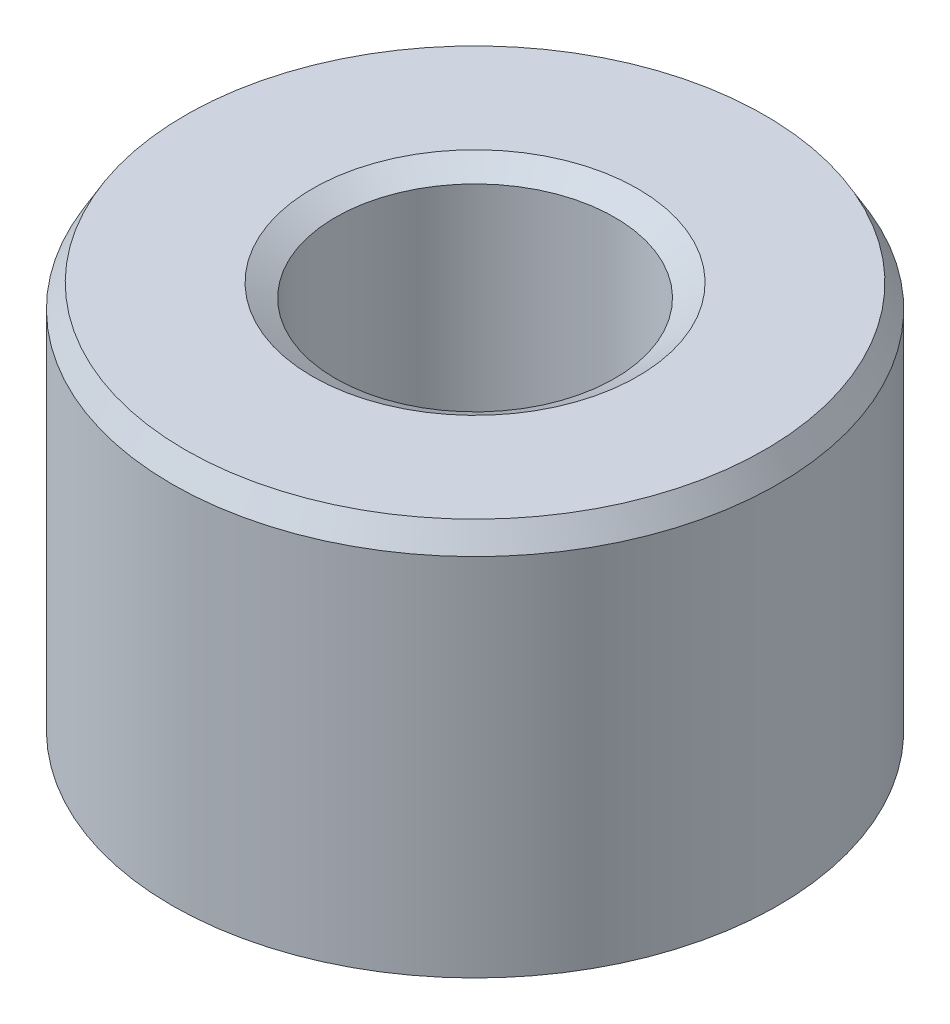
ISO-10303-21;
HEADER;
FILE_DESCRIPTION(('STEP AP214'),'2;1');
FILE_NAME('part.step','',(''),(''),'','','');
FILE_SCHEMA(('AUTOMOTIVE_DESIGN { 1 0 10303 214 1 1 1 1 }'));
ENDSEC;
DATA;
#1=APPLICATION_CONTEXT('core data for automotive mechanical design processes');
#2=APPLICATION_PROTOCOL_DEFINITION('international standard','automotive_design',2000,#1);
#3=PRODUCT_CONTEXT('',#1,'mechanical');
#4=PRODUCT('Part','Part','',(#3));
#5=PRODUCT_RELATED_PRODUCT_CATEGORY('part','',(#4));
#6=PRODUCT_DEFINITION_FORMATION('','',#4);
#7=PRODUCT_DEFINITION_CONTEXT('part definition',#1,'design');
#8=PRODUCT_DEFINITION('design','',#6,#7);
#9=PRODUCT_DEFINITION_SHAPE('','',#8);
#10=(LENGTH_UNIT() NAMED_UNIT(*) SI_UNIT(.MILLI.,.METRE.));
#11=(NAMED_UNIT(*) PLANE_ANGLE_UNIT() SI_UNIT($,.RADIAN.));
#12=(NAMED_UNIT(*) SI_UNIT($,.STERADIAN.) SOLID_ANGLE_UNIT());
#13=UNCERTAINTY_MEASURE_WITH_UNIT(LENGTH_MEASURE(1.E-05),#10,'distance_accuracy_value','');
#14=(GEOMETRIC_REPRESENTATION_CONTEXT(3) GLOBAL_UNCERTAINTY_ASSIGNED_CONTEXT((#13)) GLOBAL_UNIT_ASSIGNED_CONTEXT((#10,
#11,#12)) REPRESENTATION_CONTEXT('',''));
#15=CARTESIAN_POINT('',(0.,0.,0.));
#16=DIRECTION('',(0.,0.,1.));
#17=DIRECTION('',(1.,0.,0.));
#18=AXIS2_PLACEMENT_3D('',#15,#16,#17);
#19=CARTESIAN_POINT('',(0.,6.61881490468364,0.));
#20=DIRECTION('',(0.,-1.,0.));
#21=DIRECTION('',(0.,0.,-1.));
#22=AXIS2_PLACEMENT_3D('',#19,#20,#21);
#23=CYLINDRICAL_SURFACE('',#22,5.);
#24=CARTESIAN_POINT('',(0.,0.219312354508771,0.));
#25=DIRECTION('',(0.,1.,0.));
#26=DIRECTION('',(0.,0.,1.));
#27=AXIS2_PLACEMENT_3D('',#24,#25,#26);
#28=CIRCLE('',#27,5.);
#29=CARTESIAN_POINT('',(0.,0.219312354508771,5.));
#30=VERTEX_POINT('',#29);
#31=EDGE_CURVE('E10',#30,#30,#28,.T.);
#32=ORIENTED_EDGE('',*,*,#31,.T.);
#33=EDGE_LOOP('',(#32));
#34=FACE_BOUND('',#33,.T.);
#35=CARTESIAN_POINT('',(0.,6.23895476394689,0.));
#36=DIRECTION('',(0.,1.,0.));
#37=DIRECTION('',(0.,0.,1.));
#38=AXIS2_PLACEMENT_3D('',#35,#36,#37);
#39=CIRCLE('',#38,5.);
#40=CARTESIAN_POINT('',(0.,6.23895476394689,5.));
#41=VERTEX_POINT('',#40);
#42=EDGE_CURVE('E50',#41,#41,#39,.F.);
#43=ORIENTED_EDGE('',*,*,#42,.T.);
#44=EDGE_LOOP('',(#43));
#45=FACE_BOUND('',#44,.T.);
#46=ADVANCED_FACE('F39',(#34,#45),#23,.T.);
#47=CARTESIAN_POINT('',(0.,6.61881490468364,0.));
#48=DIRECTION('',(0.,1.,0.));
#49=DIRECTION('',(0.,0.,1.));
#50=AXIS2_PLACEMENT_3D('',#47,#48,#49);
#51=PLANE('',#50);
#52=CARTESIAN_POINT('',(0.,6.61881490468364,0.));
#53=DIRECTION('',(0.,1.,0.));
#54=DIRECTION('',(0.,0.,1.));
#55=AXIS2_PLACEMENT_3D('',#52,#53,#54);
#56=CIRCLE('',#55,2.68328908875519);
#57=CARTESIAN_POINT('',(0.,6.61881490468364,2.68328908875519));
#58=VERTEX_POINT('',#57);
#59=EDGE_CURVE('E58',#58,#58,#56,.F.);
#60=ORIENTED_EDGE('',*,*,#59,.T.);
#61=EDGE_LOOP('',(#60));
#62=FACE_BOUND('',#61,.T.);
#63=CARTESIAN_POINT('',(0.,6.61881490468364,0.));
#64=DIRECTION('',(0.,1.,0.));
#65=DIRECTION('',(0.,0.,1.));
#66=AXIS2_PLACEMENT_3D('',#63,#64,#65);
#67=CIRCLE('',#66,4.78068764549123);
#68=CARTESIAN_POINT('',(0.,6.61881490468364,4.78068764549123));
#69=VERTEX_POINT('',#68);
#70=EDGE_CURVE('E61',#69,#69,#67,.T.);
#71=ORIENTED_EDGE('',*,*,#70,.T.);
#72=EDGE_LOOP('',(#71));
#73=FACE_BOUND('',#72,.T.);
#74=ADVANCED_FACE('F88',(#62,#73),#51,.T.);
#75=CARTESIAN_POINT('',(0.,0.,0.));
#76=DIRECTION('',(0.,1.,0.));
#77=DIRECTION('',(0.,0.,1.));
#78=AXIS2_PLACEMENT_3D('',#75,#76,#77);
#79=PLANE('',#78);
#80=CARTESIAN_POINT('',(0.,0.,0.));
#81=DIRECTION('',(0.,1.,0.));
#82=DIRECTION('',(0.,0.,1.));
#83=AXIS2_PLACEMENT_3D('',#80,#81,#82);
#84=CIRCLE('',#83,2.5227413025272);
#85=CARTESIAN_POINT('',(0.,0.,2.5227413025272));
#86=VERTEX_POINT('',#85);
#87=EDGE_CURVE('E51',#86,#86,#84,.T.);
#88=ORIENTED_EDGE('',*,*,#87,.T.);
#89=EDGE_LOOP('',(#88));
#90=FACE_BOUND('',#89,.T.);
#91=CARTESIAN_POINT('',(0.,0.,0.));
#92=DIRECTION('',(0.,1.,0.));
#93=DIRECTION('',(0.,0.,1.));
#94=AXIS2_PLACEMENT_3D('',#91,#92,#93);
#95=CIRCLE('',#94,4.62013985926325);
#96=CARTESIAN_POINT('',(0.,0.,4.62013985926325));
#97=VERTEX_POINT('',#96);
#98=EDGE_CURVE('E54',#97,#97,#95,.F.);
#99=ORIENTED_EDGE('',*,*,#98,.T.);
#100=EDGE_LOOP('',(#99));
#101=FACE_BOUND('',#100,.T.);
#102=ADVANCED_FACE('F83',(#90,#101),#79,.F.);
#103=CARTESIAN_POINT('',(0.,6.61881490468364,0.));
#104=DIRECTION('',(0.,-1.,0.));
#105=DIRECTION('',(0.,0.,-1.));
#106=AXIS2_PLACEMENT_3D('',#103,#104,#105);
#107=CYLINDRICAL_SURFACE('',#106,2.30342894801844);
#108=CARTESIAN_POINT('',(0.,6.39950255017487,0.));
#109=DIRECTION('',(0.,1.,0.));
#110=DIRECTION('',(0.,0.,1.));
#111=AXIS2_PLACEMENT_3D('',#108,#109,#110);
#112=CIRCLE('',#111,2.30342894801844);
#113=CARTESIAN_POINT('',(0.,6.39950255017487,2.30342894801844));
#114=VERTEX_POINT('',#113);
#115=EDGE_CURVE('E67',#114,#114,#112,.T.);
#116=ORIENTED_EDGE('',*,*,#115,.T.);
#117=EDGE_LOOP('',(#116));
#118=FACE_BOUND('',#117,.T.);
#119=CARTESIAN_POINT('',(0.,0.379860140736748,0.));
#120=DIRECTION('',(0.,1.,0.));
#121=DIRECTION('',(0.,0.,1.));
#122=AXIS2_PLACEMENT_3D('',#119,#120,#121);
#123=CIRCLE('',#122,2.30342894801844);
#124=CARTESIAN_POINT('',(0.,0.379860140736748,2.30342894801844));
#125=VERTEX_POINT('',#124);
#126=EDGE_CURVE('E69',#125,#125,#123,.F.);
#127=ORIENTED_EDGE('',*,*,#126,.T.);
#128=EDGE_LOOP('',(#127));
#129=FACE_BOUND('',#128,.T.);
#130=ADVANCED_FACE('F71',(#118,#129),#107,.F.);
#131=CARTESIAN_POINT('',(0.,6.39950255017487,0.));
#132=DIRECTION('',(0.,1.,0.));
#133=DIRECTION('',(0.,0.,1.));
#134=AXIS2_PLACEMENT_3D('',#131,#132,#133);
#135=CONICAL_SURFACE('',#134,2.30342894801844,1.0471975511966);
#136=ORIENTED_EDGE('',*,*,#59,.F.);
#137=EDGE_LOOP('',(#136));
#138=FACE_BOUND('',#137,.T.);
#139=ORIENTED_EDGE('',*,*,#115,.F.);
#140=EDGE_LOOP('',(#139));
#141=FACE_BOUND('',#140,.T.);
#142=ADVANCED_FACE('F77',(#138,#141),#135,.F.);
#143=CARTESIAN_POINT('',(0.,0.,0.));
#144=DIRECTION('',(0.,-1.,0.));
#145=DIRECTION('',(0.,0.,-1.));
#146=AXIS2_PLACEMENT_3D('',#143,#144,#145);
#147=CONICAL_SURFACE('',#146,2.5227413025272,0.523598775598296);
#148=ORIENTED_EDGE('',*,*,#126,.F.);
#149=EDGE_LOOP('',(#148));
#150=FACE_BOUND('',#149,.T.);
#151=ORIENTED_EDGE('',*,*,#87,.F.);
#152=EDGE_LOOP('',(#151));
#153=FACE_BOUND('',#152,.T.);
#154=ADVANCED_FACE('F73',(#150,#153),#147,.F.);
#155=CARTESIAN_POINT('',(0.,0.219312354508771,0.));
#156=DIRECTION('',(0.,1.,0.));
#157=DIRECTION('',(0.,0.,1.));
#158=AXIS2_PLACEMENT_3D('',#155,#156,#157);
#159=CONICAL_SURFACE('',#158,5.,1.0471975511966);
#160=ORIENTED_EDGE('',*,*,#98,.F.);
#161=EDGE_LOOP('',(#160));
#162=FACE_BOUND('',#161,.T.);
#163=ORIENTED_EDGE('',*,*,#31,.F.);
#164=EDGE_LOOP('',(#163));
#165=FACE_BOUND('',#164,.T.);
#166=ADVANCED_FACE('F76',(#162,#165),#159,.T.);
#167=CARTESIAN_POINT('',(0.,6.61881490468364,0.));
#168=DIRECTION('',(0.,-1.,0.));
#169=DIRECTION('',(0.,0.,-1.));
#170=AXIS2_PLACEMENT_3D('',#167,#168,#169);
#171=CONICAL_SURFACE('',#170,4.78068764549123,0.523598775598296);
#172=ORIENTED_EDGE('',*,*,#42,.F.);
#173=EDGE_LOOP('',(#172));
#174=FACE_BOUND('',#173,.T.);
#175=ORIENTED_EDGE('',*,*,#70,.F.);
#176=EDGE_LOOP('',(#175));
#177=FACE_BOUND('',#176,.T.);
#178=ADVANCED_FACE('F45',(#174,#177),#171,.T.);
#179=CLOSED_SHELL('',(#46,#74,#102,#130,#142,#154,#166,#178));
#180=MANIFOLD_SOLID_BREP('B2',#179);
#181=ADVANCED_BREP_SHAPE_REPRESENTATION('',(#18,#180),#14);
#182=SHAPE_DEFINITION_REPRESENTATION(#9,#181);
ENDSEC;
END-ISO-10303-21;
